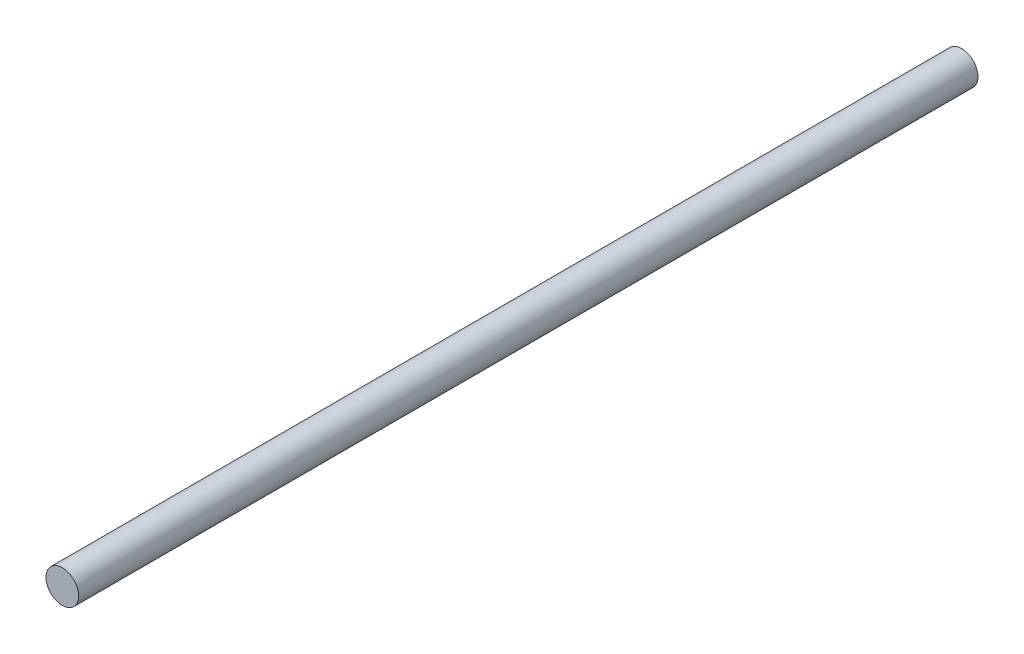
ISO-10303-21;
HEADER;
FILE_DESCRIPTION(('STEP AP214'),'2;1');
FILE_NAME('part.step','',(''),(''),'','','');
FILE_SCHEMA(('AUTOMOTIVE_DESIGN { 1 0 10303 214 1 1 1 1 }'));
ENDSEC;
DATA;
#1=APPLICATION_CONTEXT('core data for automotive mechanical design processes');
#2=APPLICATION_PROTOCOL_DEFINITION('international standard','automotive_design',2000,#1);
#3=PRODUCT_CONTEXT('',#1,'mechanical');
#4=PRODUCT('Part','Part','',(#3));
#5=PRODUCT_RELATED_PRODUCT_CATEGORY('part','',(#4));
#6=PRODUCT_DEFINITION_FORMATION('','',#4);
#7=PRODUCT_DEFINITION_CONTEXT('part definition',#1,'design');
#8=PRODUCT_DEFINITION('design','',#6,#7);
#9=PRODUCT_DEFINITION_SHAPE('','',#8);
#10=(LENGTH_UNIT() NAMED_UNIT(*) SI_UNIT(.MILLI.,.METRE.));
#11=(NAMED_UNIT(*) PLANE_ANGLE_UNIT() SI_UNIT($,.RADIAN.));
#12=(NAMED_UNIT(*) SI_UNIT($,.STERADIAN.) SOLID_ANGLE_UNIT());
#13=UNCERTAINTY_MEASURE_WITH_UNIT(LENGTH_MEASURE(1.E-05),#10,'distance_accuracy_value','');
#14=(GEOMETRIC_REPRESENTATION_CONTEXT(3) GLOBAL_UNCERTAINTY_ASSIGNED_CONTEXT((#13)) GLOBAL_UNIT_ASSIGNED_CONTEXT((#10,
#11,#12)) REPRESENTATION_CONTEXT('',''));
#15=CARTESIAN_POINT('',(0.,0.,0.));
#16=DIRECTION('',(0.,0.,1.));
#17=DIRECTION('',(1.,0.,0.));
#18=AXIS2_PLACEMENT_3D('',#15,#16,#17);
#19=CARTESIAN_POINT('',(0.,0.,220.));
#20=DIRECTION('',(0.,0.,-1.));
#21=DIRECTION('',(-1.,0.,0.));
#22=AXIS2_PLACEMENT_3D('',#19,#20,#21);
#23=CYLINDRICAL_SURFACE('',#22,4.);
#24=CARTESIAN_POINT('',(0.,0.,220.));
#25=DIRECTION('',(0.,0.,1.));
#26=DIRECTION('',(1.,0.,0.));
#27=AXIS2_PLACEMENT_3D('',#24,#25,#26);
#28=CIRCLE('',#27,4.);
#29=CARTESIAN_POINT('',(4.,0.,220.));
#30=VERTEX_POINT('',#29);
#31=EDGE_CURVE('E10',#30,#30,#28,.T.);
#32=ORIENTED_EDGE('',*,*,#31,.F.);
#33=EDGE_LOOP('',(#32));
#34=FACE_BOUND('',#33,.T.);
#35=CARTESIAN_POINT('',(0.,0.,0.));
#36=DIRECTION('',(0.,0.,1.));
#37=DIRECTION('',(1.,0.,0.));
#38=AXIS2_PLACEMENT_3D('',#35,#36,#37);
#39=CIRCLE('',#38,4.);
#40=CARTESIAN_POINT('',(4.,0.,0.));
#41=VERTEX_POINT('',#40);
#42=EDGE_CURVE('E35',#41,#41,#39,.T.);
#43=ORIENTED_EDGE('',*,*,#42,.T.);
#44=EDGE_LOOP('',(#43));
#45=FACE_BOUND('',#44,.T.);
#46=ADVANCED_FACE('F32',(#34,#45),#23,.T.);
#47=CARTESIAN_POINT('',(0.,0.,220.));
#48=DIRECTION('',(0.,0.,1.));
#49=DIRECTION('',(1.,0.,0.));
#50=AXIS2_PLACEMENT_3D('',#47,#48,#49);
#51=PLANE('',#50);
#52=ORIENTED_EDGE('',*,*,#31,.T.);
#53=EDGE_LOOP('',(#52));
#54=FACE_BOUND('',#53,.T.);
#55=ADVANCED_FACE('F47',(#54),#51,.T.);
#56=CARTESIAN_POINT('',(0.,0.,0.));
#57=DIRECTION('',(0.,0.,1.));
#58=DIRECTION('',(1.,0.,0.));
#59=AXIS2_PLACEMENT_3D('',#56,#57,#58);
#60=PLANE('',#59);
#61=ORIENTED_EDGE('',*,*,#42,.F.);
#62=EDGE_LOOP('',(#61));
#63=FACE_BOUND('',#62,.T.);
#64=ADVANCED_FACE('F45',(#63),#60,.F.);
#65=CLOSED_SHELL('',(#46,#55,#64));
#66=MANIFOLD_SOLID_BREP('B2',#65);
#67=ADVANCED_BREP_SHAPE_REPRESENTATION('',(#18,#66),#14);
#68=SHAPE_DEFINITION_REPRESENTATION(#9,#67);
ENDSEC;
END-ISO-10303-21;
